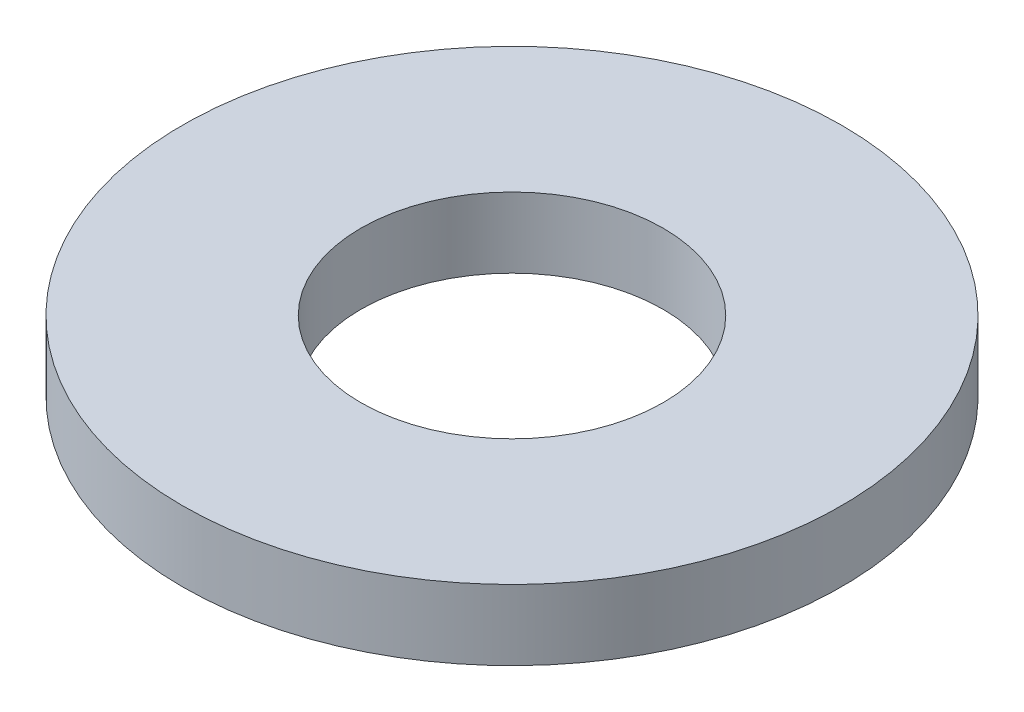
ISO-10303-21;
HEADER;
FILE_DESCRIPTION(('STEP AP214'),'2;1');
FILE_NAME('part.step','',(''),(''),'','','');
FILE_SCHEMA(('AUTOMOTIVE_DESIGN { 1 0 10303 214 1 1 1 1 }'));
ENDSEC;
DATA;
#1=APPLICATION_CONTEXT('core data for automotive mechanical design processes');
#2=APPLICATION_PROTOCOL_DEFINITION('international standard','automotive_design',2000,#1);
#3=PRODUCT_CONTEXT('',#1,'mechanical');
#4=PRODUCT('Part','Part','',(#3));
#5=PRODUCT_RELATED_PRODUCT_CATEGORY('part','',(#4));
#6=PRODUCT_DEFINITION_FORMATION('','',#4);
#7=PRODUCT_DEFINITION_CONTEXT('part definition',#1,'design');
#8=PRODUCT_DEFINITION('design','',#6,#7);
#9=PRODUCT_DEFINITION_SHAPE('','',#8);
#10=(LENGTH_UNIT() NAMED_UNIT(*) SI_UNIT(.MILLI.,.METRE.));
#11=(NAMED_UNIT(*) PLANE_ANGLE_UNIT() SI_UNIT($,.RADIAN.));
#12=(NAMED_UNIT(*) SI_UNIT($,.STERADIAN.) SOLID_ANGLE_UNIT());
#13=UNCERTAINTY_MEASURE_WITH_UNIT(LENGTH_MEASURE(1.E-05),#10,'distance_accuracy_value','');
#14=(GEOMETRIC_REPRESENTATION_CONTEXT(3) GLOBAL_UNCERTAINTY_ASSIGNED_CONTEXT((#13)) GLOBAL_UNIT_ASSIGNED_CONTEXT((#10,
#11,#12)) REPRESENTATION_CONTEXT('',''));
#15=CARTESIAN_POINT('',(0.,0.,0.));
#16=DIRECTION('',(0.,0.,1.));
#17=DIRECTION('',(1.,0.,0.));
#18=AXIS2_PLACEMENT_3D('',#15,#16,#17);
#19=CARTESIAN_POINT('',(0.,1.016,0.));
#20=DIRECTION('',(0.,-1.,0.));
#21=DIRECTION('',(0.,0.,-1.));
#22=AXIS2_PLACEMENT_3D('',#19,#20,#21);
#23=CYLINDRICAL_SURFACE('',#22,4.7625);
#24=CARTESIAN_POINT('',(0.,1.016,0.));
#25=DIRECTION('',(0.,1.,0.));
#26=DIRECTION('',(0.,0.,1.));
#27=AXIS2_PLACEMENT_3D('',#24,#25,#26);
#28=CIRCLE('',#27,4.7625);
#29=CARTESIAN_POINT('',(0.,1.016,4.7625));
#30=VERTEX_POINT('',#29);
#31=EDGE_CURVE('E10',#30,#30,#28,.T.);
#32=ORIENTED_EDGE('',*,*,#31,.F.);
#33=EDGE_LOOP('',(#32));
#34=FACE_BOUND('',#33,.T.);
#35=CARTESIAN_POINT('',(0.,0.,0.));
#36=DIRECTION('',(0.,1.,0.));
#37=DIRECTION('',(0.,0.,1.));
#38=AXIS2_PLACEMENT_3D('',#35,#36,#37);
#39=CIRCLE('',#38,4.7625);
#40=CARTESIAN_POINT('',(0.,0.,4.7625));
#41=VERTEX_POINT('',#40);
#42=EDGE_CURVE('E31',#41,#41,#39,.T.);
#43=ORIENTED_EDGE('',*,*,#42,.T.);
#44=EDGE_LOOP('',(#43));
#45=FACE_BOUND('',#44,.T.);
#46=ADVANCED_FACE('F28',(#34,#45),#23,.T.);
#47=CARTESIAN_POINT('',(0.,1.016,0.));
#48=DIRECTION('',(0.,1.,0.));
#49=DIRECTION('',(0.,0.,1.));
#50=AXIS2_PLACEMENT_3D('',#47,#48,#49);
#51=PLANE('',#50);
#52=CARTESIAN_POINT('',(0.,1.016,0.));
#53=DIRECTION('',(0.,1.,0.));
#54=DIRECTION('',(0.,0.,1.));
#55=AXIS2_PLACEMENT_3D('',#52,#53,#54);
#56=CIRCLE('',#55,2.1844);
#57=CARTESIAN_POINT('',(0.,1.016,2.1844));
#58=VERTEX_POINT('',#57);
#59=EDGE_CURVE('E40',#58,#58,#56,.T.);
#60=ORIENTED_EDGE('',*,*,#59,.F.);
#61=EDGE_LOOP('',(#60));
#62=FACE_BOUND('',#61,.T.);
#63=ORIENTED_EDGE('',*,*,#31,.T.);
#64=EDGE_LOOP('',(#63));
#65=FACE_BOUND('',#64,.T.);
#66=ADVANCED_FACE('F55',(#62,#65),#51,.T.);
#67=CARTESIAN_POINT('',(0.,0.,0.));
#68=DIRECTION('',(0.,1.,0.));
#69=DIRECTION('',(0.,0.,1.));
#70=AXIS2_PLACEMENT_3D('',#67,#68,#69);
#71=PLANE('',#70);
#72=CARTESIAN_POINT('',(0.,0.,0.));
#73=DIRECTION('',(0.,1.,0.));
#74=DIRECTION('',(0.,0.,1.));
#75=AXIS2_PLACEMENT_3D('',#72,#73,#74);
#76=CIRCLE('',#75,2.1844);
#77=CARTESIAN_POINT('',(0.,0.,2.1844));
#78=VERTEX_POINT('',#77);
#79=EDGE_CURVE('E38',#78,#78,#76,.T.);
#80=ORIENTED_EDGE('',*,*,#79,.T.);
#81=EDGE_LOOP('',(#80));
#82=FACE_BOUND('',#81,.T.);
#83=ORIENTED_EDGE('',*,*,#42,.F.);
#84=EDGE_LOOP('',(#83));
#85=FACE_BOUND('',#84,.T.);
#86=ADVANCED_FACE('F46',(#82,#85),#71,.F.);
#87=CARTESIAN_POINT('',(0.,0.,0.));
#88=DIRECTION('',(0.,1.,0.));
#89=DIRECTION('',(0.,0.,1.));
#90=AXIS2_PLACEMENT_3D('',#87,#88,#89);
#91=CYLINDRICAL_SURFACE('',#90,2.1844);
#92=ORIENTED_EDGE('',*,*,#79,.F.);
#93=EDGE_LOOP('',(#92));
#94=FACE_BOUND('',#93,.T.);
#95=ORIENTED_EDGE('',*,*,#59,.T.);
#96=EDGE_LOOP('',(#95));
#97=FACE_BOUND('',#96,.T.);
#98=ADVANCED_FACE('F49',(#94,#97),#91,.F.);
#99=CLOSED_SHELL('',(#46,#66,#86,#98));
#100=MANIFOLD_SOLID_BREP('B2',#99);
#101=ADVANCED_BREP_SHAPE_REPRESENTATION('',(#18,#100),#14);
#102=SHAPE_DEFINITION_REPRESENTATION(#9,#101);
ENDSEC;
END-ISO-10303-21;
